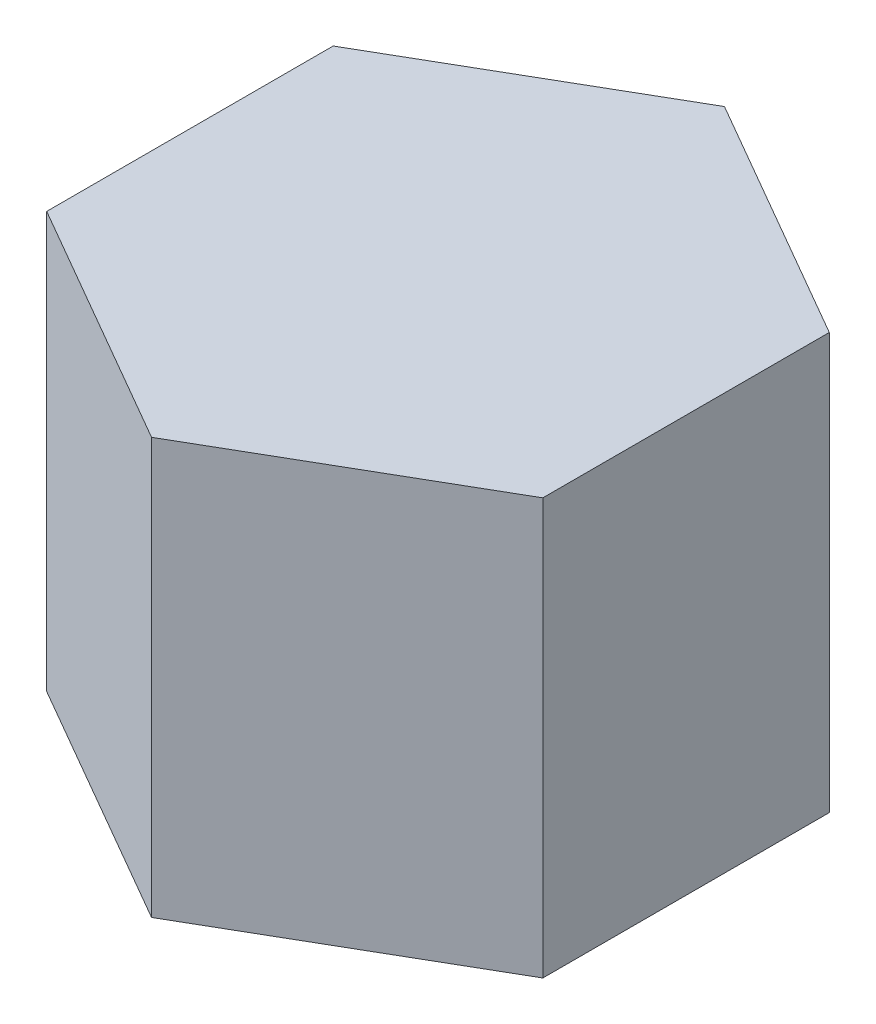
ISO-10303-21;
HEADER;
FILE_DESCRIPTION(('STEP AP214'),'2;1');
FILE_NAME('part.step','',(''),(''),'','','');
FILE_SCHEMA(('AUTOMOTIVE_DESIGN { 1 0 10303 214 1 1 1 1 }'));
ENDSEC;
DATA;
#1=APPLICATION_CONTEXT('core data for automotive mechanical design processes');
#2=APPLICATION_PROTOCOL_DEFINITION('international standard','automotive_design',2000,#1);
#3=PRODUCT_CONTEXT('',#1,'mechanical');
#4=PRODUCT('Part','Part','',(#3));
#5=PRODUCT_RELATED_PRODUCT_CATEGORY('part','',(#4));
#6=PRODUCT_DEFINITION_FORMATION('','',#4);
#7=PRODUCT_DEFINITION_CONTEXT('part definition',#1,'design');
#8=PRODUCT_DEFINITION('design','',#6,#7);
#9=PRODUCT_DEFINITION_SHAPE('','',#8);
#10=(LENGTH_UNIT() NAMED_UNIT(*) SI_UNIT(.MILLI.,.METRE.));
#11=(NAMED_UNIT(*) PLANE_ANGLE_UNIT() SI_UNIT($,.RADIAN.));
#12=(NAMED_UNIT(*) SI_UNIT($,.STERADIAN.) SOLID_ANGLE_UNIT());
#13=UNCERTAINTY_MEASURE_WITH_UNIT(LENGTH_MEASURE(1.E-05),#10,'distance_accuracy_value','');
#14=(GEOMETRIC_REPRESENTATION_CONTEXT(3) GLOBAL_UNCERTAINTY_ASSIGNED_CONTEXT((#13)) GLOBAL_UNIT_ASSIGNED_CONTEXT((#10,
#11,#12)) REPRESENTATION_CONTEXT('',''));
#15=CARTESIAN_POINT('',(0.,0.,0.));
#16=DIRECTION('',(0.,0.,1.));
#17=DIRECTION('',(1.,0.,0.));
#18=AXIS2_PLACEMENT_3D('',#15,#16,#17);
#19=CARTESIAN_POINT('',(203.142660308706,-148.537700895744,292.372996624279));
#20=DIRECTION('',(-0.499999999999909,0.,-0.866025403784491));
#21=DIRECTION('',(-0.866025403784491,0.,0.499999999999909));
#22=AXIS2_PLACEMENT_3D('',#19,#20,#21);
#23=PLANE('',#22);
#24=CARTESIAN_POINT('',(202.839551417382,-149.045793579175,292.547996624279));
#25=DIRECTION('',(0.866025403784491,0.,-0.499999999999909));
#26=VECTOR('',#25,1.);
#27=LINE('',#24,#26);
#28=CARTESIAN_POINT('',(202.839551417382,-149.045793579175,292.547996624279));
#29=VERTEX_POINT('',#28);
#30=CARTESIAN_POINT('',(203.142660308706,-149.045793579175,292.372996624279));
#31=VERTEX_POINT('',#30);
#32=EDGE_CURVE('E170',#29,#31,#27,.T.);
#33=ORIENTED_EDGE('',*,*,#32,.T.);
#34=CARTESIAN_POINT('',(203.142660308706,-148.537700895744,292.372996624279));
#35=DIRECTION('',(0.,-1.,0.));
#36=VECTOR('',#35,1.);
#37=LINE('',#34,#36);
#38=CARTESIAN_POINT('',(203.142660308706,-148.537700895744,292.372996624279));
#39=VERTEX_POINT('',#38);
#40=EDGE_CURVE('E35',#39,#31,#37,.T.);
#41=ORIENTED_EDGE('',*,*,#40,.F.);
#42=CARTESIAN_POINT('',(202.839551417382,-148.537700895744,292.547996624279));
#43=DIRECTION('',(0.866025403784491,0.,-0.499999999999909));
#44=VECTOR('',#43,1.);
#45=LINE('',#42,#44);
#46=CARTESIAN_POINT('',(202.839551417382,-148.537700895744,292.547996624279));
#47=VERTEX_POINT('',#46);
#48=EDGE_CURVE('E159',#47,#39,#45,.T.);
#49=ORIENTED_EDGE('',*,*,#48,.F.);
#50=CARTESIAN_POINT('',(202.839551417382,-148.537700895744,292.547996624279));
#51=DIRECTION('',(0.,-1.,0.));
#52=VECTOR('',#51,1.);
#53=LINE('',#50,#52);
#54=EDGE_CURVE('E10',#47,#29,#53,.T.);
#55=ORIENTED_EDGE('',*,*,#54,.T.);
#56=EDGE_LOOP('',(#33,#41,#49,#55));
#57=FACE_BOUND('',#56,.T.);
#58=ADVANCED_FACE('F16',(#57),#23,.F.);
#59=CARTESIAN_POINT('',(202.839551417382,-148.537700895744,292.547996624279));
#60=DIRECTION('',(0.499999999999978,0.,-0.866025403784452));
#61=DIRECTION('',(-0.866025403784452,0.,-0.499999999999978));
#62=AXIS2_PLACEMENT_3D('',#59,#60,#61);
#63=PLANE('',#62);
#64=CARTESIAN_POINT('',(202.536442526057,-149.045793579175,292.372996624279));
#65=DIRECTION('',(0.866025403784452,0.,0.499999999999978));
#66=VECTOR('',#65,1.);
#67=LINE('',#64,#66);
#68=CARTESIAN_POINT('',(202.536442526057,-149.045793579175,292.372996624279));
#69=VERTEX_POINT('',#68);
#70=EDGE_CURVE('E167',#69,#29,#67,.T.);
#71=ORIENTED_EDGE('',*,*,#70,.T.);
#72=ORIENTED_EDGE('',*,*,#54,.F.);
#73=CARTESIAN_POINT('',(202.536442526057,-148.537700895744,292.372996624279));
#74=DIRECTION('',(0.866025403784452,0.,0.499999999999978));
#75=VECTOR('',#74,1.);
#76=LINE('',#73,#75);
#77=CARTESIAN_POINT('',(202.536442526057,-148.537700895744,292.372996624279));
#78=VERTEX_POINT('',#77);
#79=EDGE_CURVE('E156',#78,#47,#76,.T.);
#80=ORIENTED_EDGE('',*,*,#79,.F.);
#81=CARTESIAN_POINT('',(202.536442526057,-148.537700895744,292.372996624279));
#82=DIRECTION('',(0.,-1.,0.));
#83=VECTOR('',#82,1.);
#84=LINE('',#81,#83);
#85=EDGE_CURVE('E27',#78,#69,#84,.T.);
#86=ORIENTED_EDGE('',*,*,#85,.T.);
#87=EDGE_LOOP('',(#71,#72,#80,#86));
#88=FACE_BOUND('',#87,.T.);
#89=ADVANCED_FACE('F189',(#88),#63,.F.);
#90=CARTESIAN_POINT('',(202.536442526057,-148.537700895744,290.831971220494));
#91=DIRECTION('',(1.,0.,0.));
#92=DIRECTION('',(0.,1.,0.));
#93=AXIS2_PLACEMENT_3D('',#90,#91,#92);
#94=PLANE('',#93);
#95=CARTESIAN_POINT('',(202.536442526057,-149.045793579175,292.022996624279));
#96=DIRECTION('',(0.,0.,1.));
#97=VECTOR('',#96,1.);
#98=LINE('',#95,#97);
#99=CARTESIAN_POINT('',(202.536442526057,-149.045793579175,292.022996624279));
#100=VERTEX_POINT('',#99);
#101=EDGE_CURVE('E163',#100,#69,#98,.T.);
#102=ORIENTED_EDGE('',*,*,#101,.T.);
#103=ORIENTED_EDGE('',*,*,#85,.F.);
#104=CARTESIAN_POINT('',(202.536442526057,-148.537700895744,292.022996624279));
#105=DIRECTION('',(0.,0.,1.));
#106=VECTOR('',#105,1.);
#107=LINE('',#104,#106);
#108=CARTESIAN_POINT('',(202.536442526057,-148.537700895744,292.022996624279));
#109=VERTEX_POINT('',#108);
#110=EDGE_CURVE('E106',#109,#78,#107,.T.);
#111=ORIENTED_EDGE('',*,*,#110,.F.);
#112=CARTESIAN_POINT('',(202.536442526057,-148.537700895744,292.022996624279));
#113=DIRECTION('',(0.,-1.,0.));
#114=VECTOR('',#113,1.);
#115=LINE('',#112,#114);
#116=EDGE_CURVE('E94',#109,#100,#115,.T.);
#117=ORIENTED_EDGE('',*,*,#116,.T.);
#118=EDGE_LOOP('',(#102,#103,#111,#117));
#119=FACE_BOUND('',#118,.T.);
#120=ADVANCED_FACE('F198',(#119),#94,.F.);
#121=CARTESIAN_POINT('',(202.536442526057,-148.537700895744,292.022996624279));
#122=DIRECTION('',(0.499999999999943,0.,0.866025403784472));
#123=DIRECTION('',(0.866025403784472,0.,-0.499999999999943));
#124=AXIS2_PLACEMENT_3D('',#121,#122,#123);
#125=PLANE('',#124);
#126=CARTESIAN_POINT('',(202.839551417382,-149.045793579175,291.847996624279));
#127=DIRECTION('',(-0.866025403784471,0.,0.499999999999943));
#128=VECTOR('',#127,1.);
#129=LINE('',#126,#128);
#130=CARTESIAN_POINT('',(202.839551417382,-149.045793579175,291.847996624279));
#131=VERTEX_POINT('',#130);
#132=EDGE_CURVE('E162',#131,#100,#129,.T.);
#133=ORIENTED_EDGE('',*,*,#132,.T.);
#134=ORIENTED_EDGE('',*,*,#116,.F.);
#135=CARTESIAN_POINT('',(202.839551417382,-148.537700895744,291.847996624279));
#136=DIRECTION('',(-0.866025403784471,0.,0.499999999999943));
#137=VECTOR('',#136,1.);
#138=LINE('',#135,#137);
#139=CARTESIAN_POINT('',(202.839551417382,-148.537700895744,291.847996624279));
#140=VERTEX_POINT('',#139);
#141=EDGE_CURVE('E98',#140,#109,#138,.T.);
#142=ORIENTED_EDGE('',*,*,#141,.F.);
#143=CARTESIAN_POINT('',(202.839551417382,-148.537700895744,291.847996624279));
#144=DIRECTION('',(0.,-1.,0.));
#145=VECTOR('',#144,1.);
#146=LINE('',#143,#145);
#147=EDGE_CURVE('E79',#140,#131,#146,.T.);
#148=ORIENTED_EDGE('',*,*,#147,.T.);
#149=EDGE_LOOP('',(#133,#134,#142,#148));
#150=FACE_BOUND('',#149,.T.);
#151=ADVANCED_FACE('F100',(#150),#125,.F.);
#152=CARTESIAN_POINT('',(202.839551417381,-148.537700895744,291.847996624279));
#153=DIRECTION('',(-0.500000000000028,0.,0.866025403784423));
#154=DIRECTION('',(0.866025403784423,0.,0.500000000000028));
#155=AXIS2_PLACEMENT_3D('',#152,#153,#154);
#156=PLANE('',#155);
#157=CARTESIAN_POINT('',(203.142660308706,-149.045793579175,292.022996624279));
#158=DIRECTION('',(-0.866025403784422,0.,-0.500000000000028));
#159=VECTOR('',#158,1.);
#160=LINE('',#157,#159);
#161=CARTESIAN_POINT('',(203.142660308706,-149.045793579175,292.022996624279));
#162=VERTEX_POINT('',#161);
#163=EDGE_CURVE('E88',#162,#131,#160,.T.);
#164=ORIENTED_EDGE('',*,*,#163,.T.);
#165=ORIENTED_EDGE('',*,*,#147,.F.);
#166=CARTESIAN_POINT('',(203.142660308706,-148.537700895744,292.022996624279));
#167=DIRECTION('',(-0.866025403784422,0.,-0.500000000000028));
#168=VECTOR('',#167,1.);
#169=LINE('',#166,#168);
#170=CARTESIAN_POINT('',(203.142660308706,-148.537700895744,292.022996624279));
#171=VERTEX_POINT('',#170);
#172=EDGE_CURVE('E84',#171,#140,#169,.T.);
#173=ORIENTED_EDGE('',*,*,#172,.F.);
#174=CARTESIAN_POINT('',(203.142660308706,-148.537700895744,292.022996624279));
#175=DIRECTION('',(0.,-1.,0.));
#176=VECTOR('',#175,1.);
#177=LINE('',#174,#176);
#178=EDGE_CURVE('E58',#171,#162,#177,.T.);
#179=ORIENTED_EDGE('',*,*,#178,.T.);
#180=EDGE_LOOP('',(#164,#165,#173,#179));
#181=FACE_BOUND('',#180,.T.);
#182=ADVANCED_FACE('F82',(#181),#156,.F.);
#183=CARTESIAN_POINT('',(203.142660308706,-148.537700895744,290.831971220494));
#184=DIRECTION('',(-1.,0.,0.));
#185=DIRECTION('',(0.,-1.,0.));
#186=AXIS2_PLACEMENT_3D('',#183,#184,#185);
#187=PLANE('',#186);
#188=CARTESIAN_POINT('',(203.142660308706,-149.045793579175,292.372996624279));
#189=DIRECTION('',(0.,0.,-1.));
#190=VECTOR('',#189,1.);
#191=LINE('',#188,#190);
#192=EDGE_CURVE('E160',#31,#162,#191,.T.);
#193=ORIENTED_EDGE('',*,*,#192,.T.);
#194=ORIENTED_EDGE('',*,*,#178,.F.);
#195=CARTESIAN_POINT('',(203.142660308706,-148.537700895744,292.372996624279));
#196=DIRECTION('',(0.,0.,-1.));
#197=VECTOR('',#196,1.);
#198=LINE('',#195,#197);
#199=EDGE_CURVE('E112',#39,#171,#198,.T.);
#200=ORIENTED_EDGE('',*,*,#199,.F.);
#201=ORIENTED_EDGE('',*,*,#40,.T.);
#202=EDGE_LOOP('',(#193,#194,#200,#201));
#203=FACE_BOUND('',#202,.T.);
#204=ADVANCED_FACE('F131',(#203),#187,.F.);
#205=CARTESIAN_POINT('',(206.339551417382,-148.537700895744,290.831971220494));
#206=DIRECTION('',(0.,-1.,0.));
#207=DIRECTION('',(1.,0.,0.));
#208=AXIS2_PLACEMENT_3D('',#205,#206,#207);
#209=PLANE('',#208);
#210=ORIENTED_EDGE('',*,*,#48,.T.);
#211=ORIENTED_EDGE('',*,*,#199,.T.);
#212=ORIENTED_EDGE('',*,*,#172,.T.);
#213=ORIENTED_EDGE('',*,*,#141,.T.);
#214=ORIENTED_EDGE('',*,*,#110,.T.);
#215=ORIENTED_EDGE('',*,*,#79,.T.);
#216=EDGE_LOOP('',(#210,#211,#212,#213,#214,#215));
#217=FACE_BOUND('',#216,.T.);
#218=ADVANCED_FACE('F111',(#217),#209,.F.);
#219=CARTESIAN_POINT('',(206.339551417382,-149.045793579175,290.831971220494));
#220=DIRECTION('',(0.,-1.,0.));
#221=DIRECTION('',(1.,0.,0.));
#222=AXIS2_PLACEMENT_3D('',#219,#220,#221);
#223=PLANE('',#222);
#224=ORIENTED_EDGE('',*,*,#32,.F.);
#225=ORIENTED_EDGE('',*,*,#70,.F.);
#226=ORIENTED_EDGE('',*,*,#101,.F.);
#227=ORIENTED_EDGE('',*,*,#132,.F.);
#228=ORIENTED_EDGE('',*,*,#163,.F.);
#229=ORIENTED_EDGE('',*,*,#192,.F.);
#230=EDGE_LOOP('',(#224,#225,#226,#227,#228,#229));
#231=FACE_BOUND('',#230,.T.);
#232=ADVANCED_FACE('F130',(#231),#223,.T.);
#233=CLOSED_SHELL('',(#58,#89,#120,#151,#182,#204,#218,#232));
#234=MANIFOLD_SOLID_BREP('B1',#233);
#235=ADVANCED_BREP_SHAPE_REPRESENTATION('',(#18,#234),#14);
#236=SHAPE_DEFINITION_REPRESENTATION(#9,#235);
ENDSEC;
END-ISO-10303-21;
